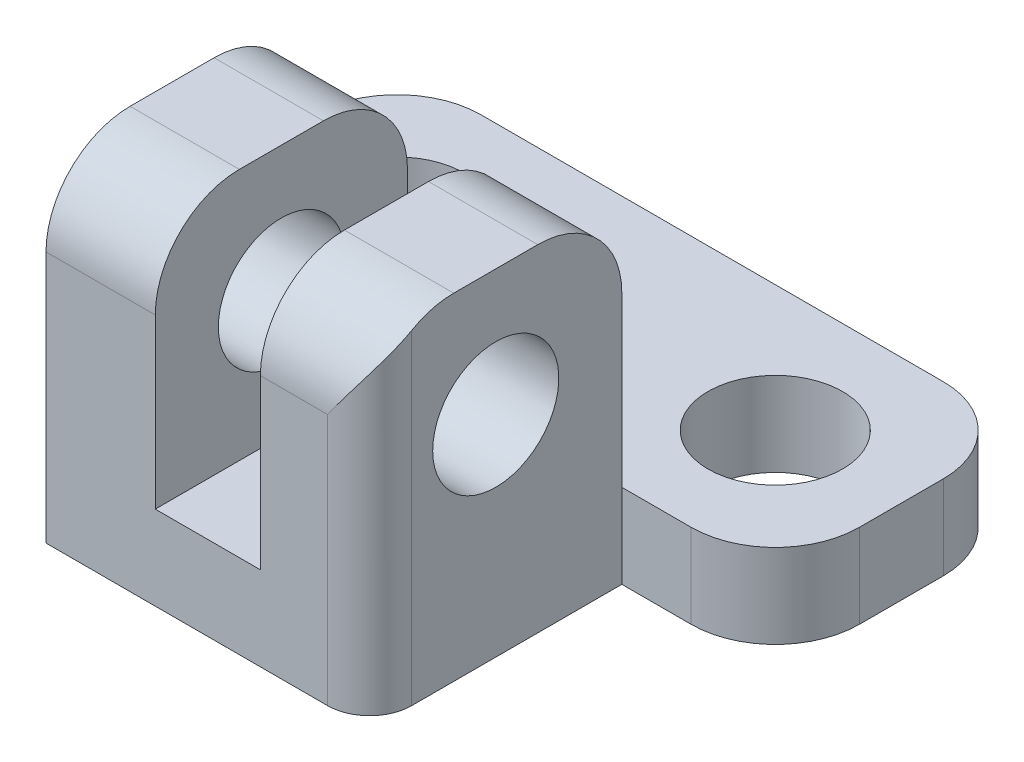
ISO-10303-21;
HEADER;
FILE_DESCRIPTION(('STEP AP214'),'2;1');
FILE_NAME('part.step','',(''),(''),'','','');
FILE_SCHEMA(('AUTOMOTIVE_DESIGN { 1 0 10303 214 1 1 1 1 }'));
ENDSEC;
DATA;
#1=APPLICATION_CONTEXT('core data for automotive mechanical design processes');
#2=APPLICATION_PROTOCOL_DEFINITION('international standard','automotive_design',2000,#1);
#3=PRODUCT_CONTEXT('',#1,'mechanical');
#4=PRODUCT('Part','Part','',(#3));
#5=PRODUCT_RELATED_PRODUCT_CATEGORY('part','',(#4));
#6=PRODUCT_DEFINITION_FORMATION('','',#4);
#7=PRODUCT_DEFINITION_CONTEXT('part definition',#1,'design');
#8=PRODUCT_DEFINITION('design','',#6,#7);
#9=PRODUCT_DEFINITION_SHAPE('','',#8);
#10=(LENGTH_UNIT() NAMED_UNIT(*) SI_UNIT(.MILLI.,.METRE.));
#11=(NAMED_UNIT(*) PLANE_ANGLE_UNIT() SI_UNIT($,.RADIAN.));
#12=(NAMED_UNIT(*) SI_UNIT($,.STERADIAN.) SOLID_ANGLE_UNIT());
#13=UNCERTAINTY_MEASURE_WITH_UNIT(LENGTH_MEASURE(1.E-05),#10,'distance_accuracy_value','');
#14=(GEOMETRIC_REPRESENTATION_CONTEXT(3) GLOBAL_UNCERTAINTY_ASSIGNED_CONTEXT((#13)) GLOBAL_UNIT_ASSIGNED_CONTEXT((#10,
#11,#12)) REPRESENTATION_CONTEXT('',''));
#15=CARTESIAN_POINT('',(0.,0.,0.));
#16=DIRECTION('',(0.,0.,1.));
#17=DIRECTION('',(1.,0.,0.));
#18=AXIS2_PLACEMENT_3D('',#15,#16,#17);
#19=CARTESIAN_POINT('',(0.,8.,-6.));
#20=DIRECTION('',(0.,0.,1.));
#21=DIRECTION('',(1.,0.,0.));
#22=AXIS2_PLACEMENT_3D('',#19,#20,#21);
#23=PLANE('',#22);
#24=DIRECTION('',(0.,-1.,0.));
#25=VECTOR('',#24,1.);
#26=CARTESIAN_POINT('',(0.,8.,-6.));
#27=LINE('',#26,#25);
#28=CARTESIAN_POINT('',(0.,6.,-6.));
#29=VERTEX_POINT('',#28);
#30=CARTESIAN_POINT('',(0.,2.,-6.));
#31=VERTEX_POINT('',#30);
#32=EDGE_CURVE('E219',#29,#31,#27,.T.);
#33=ORIENTED_EDGE('',*,*,#32,.F.);
#34=DIRECTION('',(-1.,0.,0.));
#35=VECTOR('',#34,1.);
#36=CARTESIAN_POINT('',(0.,6.,-6.));
#37=LINE('',#36,#35);
#38=CARTESIAN_POINT('',(2.6,6.,-6.));
#39=VERTEX_POINT('',#38);
#40=EDGE_CURVE('E376',#29,#39,#37,.F.);
#41=ORIENTED_EDGE('',*,*,#40,.T.);
#42=DIRECTION('',(0.,1.,0.));
#43=VECTOR('',#42,1.);
#44=CARTESIAN_POINT('',(2.6,-6.5,-6.));
#45=LINE('',#44,#43);
#46=CARTESIAN_POINT('',(2.6,2.,-6.));
#47=VERTEX_POINT('',#46);
#48=EDGE_CURVE('E303',#47,#39,#45,.T.);
#49=ORIENTED_EDGE('',*,*,#48,.F.);
#50=DIRECTION('',(1.,0.,0.));
#51=VECTOR('',#50,1.);
#52=CARTESIAN_POINT('',(-3.65,2.,-6.));
#53=LINE('',#52,#51);
#54=EDGE_CURVE('E231',#31,#47,#53,.T.);
#55=ORIENTED_EDGE('',*,*,#54,.F.);
#56=EDGE_LOOP('',(#33,#41,#49,#55));
#57=FACE_BOUND('',#56,.T.);
#58=ADVANCED_FACE('F40',(#57),#23,.F.);
#59=DIRECTION('',(0.,1.,0.));
#60=VECTOR('',#59,1.);
#61=CARTESIAN_POINT('',(5.1,-6.5,-6.));
#62=LINE('',#61,#60);
#63=CARTESIAN_POINT('',(5.1,2.,-6.));
#64=VERTEX_POINT('',#63);
#65=CARTESIAN_POINT('',(5.1,6.,-6.));
#66=VERTEX_POINT('',#65);
#67=EDGE_CURVE('E306',#64,#66,#62,.T.);
#68=ORIENTED_EDGE('',*,*,#67,.T.);
#69=DIRECTION('',(-1.,0.,0.));
#70=VECTOR('',#69,1.);
#71=CARTESIAN_POINT('',(0.,6.,-6.));
#72=LINE('',#71,#70);
#73=CARTESIAN_POINT('',(7.7,6.,-6.));
#74=VERTEX_POINT('',#73);
#75=EDGE_CURVE('E202',#66,#74,#72,.F.);
#76=ORIENTED_EDGE('',*,*,#75,.T.);
#77=DIRECTION('',(0.,-1.,0.));
#78=VECTOR('',#77,1.);
#79=CARTESIAN_POINT('',(7.7,8.,-6.));
#80=LINE('',#79,#78);
#81=CARTESIAN_POINT('',(7.7,2.,-6.));
#82=VERTEX_POINT('',#81);
#83=EDGE_CURVE('E194',#74,#82,#80,.T.);
#84=ORIENTED_EDGE('',*,*,#83,.T.);
#85=EDGE_CURVE('E199',#64,#82,#53,.T.);
#86=ORIENTED_EDGE('',*,*,#85,.F.);
#87=EDGE_LOOP('',(#68,#76,#84,#86));
#88=FACE_BOUND('',#87,.T.);
#89=ADVANCED_FACE('F197',(#88),#23,.F.);
#90=CARTESIAN_POINT('',(0.,8.,0.));
#91=DIRECTION('',(0.,-1.,0.));
#92=DIRECTION('',(0.,0.,-1.));
#93=AXIS2_PLACEMENT_3D('',#90,#91,#92);
#94=PLANE('',#93);
#95=DIRECTION('',(0.,0.,-1.));
#96=VECTOR('',#95,1.);
#97=CARTESIAN_POINT('',(7.7,8.,0.));
#98=LINE('',#97,#96);
#99=CARTESIAN_POINT('',(7.7,8.,-2.));
#100=VERTEX_POINT('',#99);
#101=CARTESIAN_POINT('',(7.7,8.,-4.));
#102=VERTEX_POINT('',#101);
#103=EDGE_CURVE('E323',#100,#102,#98,.T.);
#104=ORIENTED_EDGE('',*,*,#103,.T.);
#105=DIRECTION('',(-1.,0.,0.));
#106=VECTOR('',#105,1.);
#107=CARTESIAN_POINT('',(0.,8.,-4.));
#108=LINE('',#107,#106);
#109=CARTESIAN_POINT('',(5.1,8.,-4.));
#110=VERTEX_POINT('',#109);
#111=EDGE_CURVE('E344',#102,#110,#108,.T.);
#112=ORIENTED_EDGE('',*,*,#111,.T.);
#113=DIRECTION('',(0.,0.,-1.));
#114=VECTOR('',#113,1.);
#115=CARTESIAN_POINT('',(5.1,8.,-6.));
#116=LINE('',#115,#114);
#117=CARTESIAN_POINT('',(5.1,8.,-2.));
#118=VERTEX_POINT('',#117);
#119=EDGE_CURVE('E288',#118,#110,#116,.T.);
#120=ORIENTED_EDGE('',*,*,#119,.F.);
#121=DIRECTION('',(1.,0.,0.));
#122=VECTOR('',#121,1.);
#123=CARTESIAN_POINT('',(0.,8.,-2.));
#124=LINE('',#123,#122);
#125=EDGE_CURVE('E241',#118,#100,#124,.T.);
#126=ORIENTED_EDGE('',*,*,#125,.T.);
#127=EDGE_LOOP('',(#104,#112,#120,#126));
#128=FACE_BOUND('',#127,.T.);
#129=ADVANCED_FACE('F510',(#128),#94,.F.);
#130=CARTESIAN_POINT('',(0.,8.,0.));
#131=DIRECTION('',(1.,0.,0.));
#132=DIRECTION('',(0.,0.,-1.));
#133=AXIS2_PLACEMENT_3D('',#130,#131,#132);
#134=PLANE('',#133);
#135=CARTESIAN_POINT('',(0.,5.,-3.));
#136=DIRECTION('',(-1.,0.,0.));
#137=DIRECTION('',(0.,0.,1.));
#138=AXIS2_PLACEMENT_3D('',#135,#136,#137);
#139=CIRCLE('',#138,1.5);
#140=CARTESIAN_POINT('',(0.,5.,-1.5));
#141=VERTEX_POINT('',#140);
#142=EDGE_CURVE('E255',#141,#141,#139,.T.);
#143=ORIENTED_EDGE('',*,*,#142,.F.);
#144=EDGE_LOOP('',(#143));
#145=FACE_BOUND('',#144,.T.);
#146=DIRECTION('',(0.,0.,1.));
#147=VECTOR('',#146,1.);
#148=CARTESIAN_POINT('',(0.,8.,0.));
#149=LINE('',#148,#147);
#150=CARTESIAN_POINT('',(0.,8.,-4.));
#151=VERTEX_POINT('',#150);
#152=CARTESIAN_POINT('',(0.,8.,-2.));
#153=VERTEX_POINT('',#152);
#154=EDGE_CURVE('E319',#151,#153,#149,.T.);
#155=ORIENTED_EDGE('',*,*,#154,.F.);
#156=CARTESIAN_POINT('',(0.,6.,-4.));
#157=DIRECTION('',(1.,0.,0.));
#158=DIRECTION('',(0.,0.,-1.));
#159=AXIS2_PLACEMENT_3D('',#156,#157,#158);
#160=CIRCLE('',#159,2.);
#161=EDGE_CURVE('E373',#151,#29,#160,.F.);
#162=ORIENTED_EDGE('',*,*,#161,.T.);
#163=ORIENTED_EDGE('',*,*,#32,.T.);
#164=CARTESIAN_POINT('',(0.,0.,-6.));
#165=VERTEX_POINT('',#164);
#166=EDGE_CURVE('E327',#31,#165,#27,.T.);
#167=ORIENTED_EDGE('',*,*,#166,.T.);
#168=DIRECTION('',(0.,0.,1.));
#169=VECTOR('',#168,1.);
#170=CARTESIAN_POINT('',(0.,0.,0.));
#171=LINE('',#170,#169);
#172=CARTESIAN_POINT('',(0.,0.,0.));
#173=VERTEX_POINT('',#172);
#174=EDGE_CURVE('E318',#165,#173,#171,.T.);
#175=ORIENTED_EDGE('',*,*,#174,.T.);
#176=DIRECTION('',(0.,-1.,0.));
#177=VECTOR('',#176,1.);
#178=CARTESIAN_POINT('',(0.,8.,0.));
#179=LINE('',#178,#177);
#180=CARTESIAN_POINT('',(0.,6.,0.));
#181=VERTEX_POINT('',#180);
#182=EDGE_CURVE('E206',#181,#173,#179,.T.);
#183=ORIENTED_EDGE('',*,*,#182,.F.);
#184=CARTESIAN_POINT('',(0.,6.,-2.));
#185=DIRECTION('',(1.,0.,0.));
#186=DIRECTION('',(0.,0.,-1.));
#187=AXIS2_PLACEMENT_3D('',#184,#185,#186);
#188=CIRCLE('',#187,2.);
#189=EDGE_CURVE('E370',#181,#153,#188,.F.);
#190=ORIENTED_EDGE('',*,*,#189,.T.);
#191=EDGE_LOOP('',(#155,#162,#163,#167,#175,#183,#190));
#192=FACE_BOUND('',#191,.T.);
#193=ADVANCED_FACE('F522',(#145,#192),#134,.F.);
#194=CARTESIAN_POINT('',(0.,8.,0.));
#195=DIRECTION('',(0.,0.,-1.));
#196=DIRECTION('',(-1.,0.,0.));
#197=AXIS2_PLACEMENT_3D('',#194,#195,#196);
#198=PLANE('',#197);
#199=DIRECTION('',(1.,0.,0.));
#200=VECTOR('',#199,1.);
#201=CARTESIAN_POINT('',(0.,0.,0.));
#202=LINE('',#201,#200);
#203=CARTESIAN_POINT('',(6.7,0.,0.));
#204=VERTEX_POINT('',#203);
#205=EDGE_CURVE('E331',#173,#204,#202,.T.);
#206=ORIENTED_EDGE('',*,*,#205,.T.);
#207=DIRECTION('',(0.,-1.,0.));
#208=VECTOR('',#207,1.);
#209=CARTESIAN_POINT('',(6.7,8.,0.));
#210=LINE('',#209,#208);
#211=CARTESIAN_POINT('',(6.7,6.,0.));
#212=VERTEX_POINT('',#211);
#213=EDGE_CURVE('E55',#204,#212,#210,.F.);
#214=ORIENTED_EDGE('',*,*,#213,.T.);
#215=DIRECTION('',(1.,0.,0.));
#216=VECTOR('',#215,1.);
#217=CARTESIAN_POINT('',(0.,6.,0.));
#218=LINE('',#217,#216);
#219=CARTESIAN_POINT('',(5.1,6.,0.));
#220=VERTEX_POINT('',#219);
#221=EDGE_CURVE('E388',#212,#220,#218,.F.);
#222=ORIENTED_EDGE('',*,*,#221,.T.);
#223=DIRECTION('',(0.,1.,0.));
#224=VECTOR('',#223,1.);
#225=CARTESIAN_POINT('',(5.1,-6.5,0.));
#226=LINE('',#225,#224);
#227=CARTESIAN_POINT('',(5.1,2.,0.));
#228=VERTEX_POINT('',#227);
#229=EDGE_CURVE('E298',#228,#220,#226,.T.);
#230=ORIENTED_EDGE('',*,*,#229,.F.);
#231=DIRECTION('',(1.,0.,0.));
#232=VECTOR('',#231,1.);
#233=CARTESIAN_POINT('',(2.6,2.,0.));
#234=LINE('',#233,#232);
#235=CARTESIAN_POINT('',(2.6,2.,0.));
#236=VERTEX_POINT('',#235);
#237=EDGE_CURVE('E292',#236,#228,#234,.T.);
#238=ORIENTED_EDGE('',*,*,#237,.F.);
#239=DIRECTION('',(0.,1.,0.));
#240=VECTOR('',#239,1.);
#241=CARTESIAN_POINT('',(2.6,-6.5,0.));
#242=LINE('',#241,#240);
#243=CARTESIAN_POINT('',(2.6,6.,0.));
#244=VERTEX_POINT('',#243);
#245=EDGE_CURVE('E302',#236,#244,#242,.T.);
#246=ORIENTED_EDGE('',*,*,#245,.T.);
#247=DIRECTION('',(1.,0.,0.));
#248=VECTOR('',#247,1.);
#249=CARTESIAN_POINT('',(0.,6.,0.));
#250=LINE('',#249,#248);
#251=EDGE_CURVE('E385',#244,#181,#250,.F.);
#252=ORIENTED_EDGE('',*,*,#251,.T.);
#253=ORIENTED_EDGE('',*,*,#182,.T.);
#254=EDGE_LOOP('',(#206,#214,#222,#230,#238,#246,#252,#253));
#255=FACE_BOUND('',#254,.T.);
#256=ADVANCED_FACE('F518',(#255),#198,.F.);
#257=CARTESIAN_POINT('',(7.7,8.,0.));
#258=DIRECTION('',(-1.,0.,0.));
#259=DIRECTION('',(0.,0.,1.));
#260=AXIS2_PLACEMENT_3D('',#257,#258,#259);
#261=PLANE('',#260);
#262=CARTESIAN_POINT('',(7.7,5.,-3.));
#263=DIRECTION('',(-1.,0.,0.));
#264=DIRECTION('',(0.,0.,1.));
#265=AXIS2_PLACEMENT_3D('',#262,#263,#264);
#266=CIRCLE('',#265,1.5);
#267=CARTESIAN_POINT('',(7.7,5.,-1.5));
#268=VERTEX_POINT('',#267);
#269=EDGE_CURVE('E278',#268,#268,#266,.T.);
#270=ORIENTED_EDGE('',*,*,#269,.T.);
#271=EDGE_LOOP('',(#270));
#272=FACE_BOUND('',#271,.T.);
#273=CARTESIAN_POINT('',(7.7,6.,-2.));
#274=DIRECTION('',(-1.,0.,0.));
#275=DIRECTION('',(0.,0.,1.));
#276=AXIS2_PLACEMENT_3D('',#273,#274,#275);
#277=CIRCLE('',#276,2.);
#278=CARTESIAN_POINT('',(7.7,7.73205080756888,-1.));
#279=VERTEX_POINT('',#278);
#280=EDGE_CURVE('E356',#100,#279,#277,.F.);
#281=ORIENTED_EDGE('',*,*,#280,.T.);
#282=DIRECTION('',(0.,-1.,0.));
#283=VECTOR('',#282,1.);
#284=CARTESIAN_POINT('',(7.7,8.,-1.));
#285=LINE('',#284,#283);
#286=CARTESIAN_POINT('',(7.7,0.,-1.));
#287=VERTEX_POINT('',#286);
#288=EDGE_CURVE('E442',#279,#287,#285,.T.);
#289=ORIENTED_EDGE('',*,*,#288,.T.);
#290=DIRECTION('',(0.,0.,-1.));
#291=VECTOR('',#290,1.);
#292=CARTESIAN_POINT('',(7.7,0.,0.));
#293=LINE('',#292,#291);
#294=CARTESIAN_POINT('',(7.7,0.,-6.));
#295=VERTEX_POINT('',#294);
#296=EDGE_CURVE('E214',#287,#295,#293,.T.);
#297=ORIENTED_EDGE('',*,*,#296,.T.);
#298=EDGE_CURVE('E207',#82,#295,#80,.T.);
#299=ORIENTED_EDGE('',*,*,#298,.F.);
#300=ORIENTED_EDGE('',*,*,#83,.F.);
#301=CARTESIAN_POINT('',(7.7,6.,-4.));
#302=DIRECTION('',(-1.,0.,0.));
#303=DIRECTION('',(0.,0.,1.));
#304=AXIS2_PLACEMENT_3D('',#301,#302,#303);
#305=CIRCLE('',#304,2.);
#306=EDGE_CURVE('E359',#74,#102,#305,.F.);
#307=ORIENTED_EDGE('',*,*,#306,.T.);
#308=ORIENTED_EDGE('',*,*,#103,.F.);
#309=EDGE_LOOP('',(#281,#289,#297,#299,#300,#307,#308));
#310=FACE_BOUND('',#309,.T.);
#311=ADVANCED_FACE('F212',(#272,#310),#261,.F.);
#312=DIRECTION('',(0.,0.,1.));
#313=VECTOR('',#312,1.);
#314=CARTESIAN_POINT('',(2.6,8.,-6.));
#315=LINE('',#314,#313);
#316=CARTESIAN_POINT('',(2.6,8.,-4.));
#317=VERTEX_POINT('',#316);
#318=CARTESIAN_POINT('',(2.6,8.,-2.));
#319=VERTEX_POINT('',#318);
#320=EDGE_CURVE('E287',#317,#319,#315,.T.);
#321=ORIENTED_EDGE('',*,*,#320,.F.);
#322=DIRECTION('',(-1.,0.,0.));
#323=VECTOR('',#322,1.);
#324=CARTESIAN_POINT('',(0.,8.,-4.));
#325=LINE('',#324,#323);
#326=EDGE_CURVE('E366',#317,#151,#325,.T.);
#327=ORIENTED_EDGE('',*,*,#326,.T.);
#328=ORIENTED_EDGE('',*,*,#154,.T.);
#329=DIRECTION('',(1.,0.,0.));
#330=VECTOR('',#329,1.);
#331=CARTESIAN_POINT('',(0.,8.,-2.));
#332=LINE('',#331,#330);
#333=EDGE_CURVE('E362',#153,#319,#332,.T.);
#334=ORIENTED_EDGE('',*,*,#333,.T.);
#335=EDGE_LOOP('',(#321,#327,#328,#334));
#336=FACE_BOUND('',#335,.T.);
#337=ADVANCED_FACE('F517',(#336),#94,.F.);
#338=CARTESIAN_POINT('',(0.,0.,0.));
#339=DIRECTION('',(0.,-1.,0.));
#340=DIRECTION('',(0.,0.,-1.));
#341=AXIS2_PLACEMENT_3D('',#338,#339,#340);
#342=PLANE('',#341);
#343=CARTESIAN_POINT('',(-0.65,0.,-9.));
#344=DIRECTION('',(0.,1.,0.));
#345=DIRECTION('',(0.,0.,1.));
#346=AXIS2_PLACEMENT_3D('',#343,#344,#345);
#347=CIRCLE('',#346,1.6);
#348=CARTESIAN_POINT('',(-0.65,0.,-7.4));
#349=VERTEX_POINT('',#348);
#350=EDGE_CURVE('E471',#349,#349,#347,.T.);
#351=ORIENTED_EDGE('',*,*,#350,.T.);
#352=EDGE_LOOP('',(#351));
#353=FACE_BOUND('',#352,.T.);
#354=CARTESIAN_POINT('',(8.35,0.,-9.));
#355=DIRECTION('',(0.,1.,0.));
#356=DIRECTION('',(0.,0.,1.));
#357=AXIS2_PLACEMENT_3D('',#354,#355,#356);
#358=CIRCLE('',#357,1.6);
#359=CARTESIAN_POINT('',(8.35,0.,-7.4));
#360=VERTEX_POINT('',#359);
#361=EDGE_CURVE('E263',#360,#360,#358,.T.);
#362=ORIENTED_EDGE('',*,*,#361,.T.);
#363=EDGE_LOOP('',(#362));
#364=FACE_BOUND('',#363,.T.);
#365=ORIENTED_EDGE('',*,*,#296,.F.);
#366=CARTESIAN_POINT('',(6.7,0.,-1.));
#367=DIRECTION('',(0.,-1.,0.));
#368=DIRECTION('',(0.,0.,-1.));
#369=AXIS2_PLACEMENT_3D('',#366,#367,#368);
#370=CIRCLE('',#369,1.);
#371=EDGE_CURVE('E69',#287,#204,#370,.T.);
#372=ORIENTED_EDGE('',*,*,#371,.T.);
#373=ORIENTED_EDGE('',*,*,#205,.F.);
#374=ORIENTED_EDGE('',*,*,#174,.F.);
#375=DIRECTION('',(-1.,0.,0.));
#376=VECTOR('',#375,1.);
#377=CARTESIAN_POINT('',(-3.65,0.,-6.));
#378=LINE('',#377,#376);
#379=CARTESIAN_POINT('',(-1.65,0.,-6.));
#380=VERTEX_POINT('',#379);
#381=EDGE_CURVE('E271',#165,#380,#378,.T.);
#382=ORIENTED_EDGE('',*,*,#381,.T.);
#383=CARTESIAN_POINT('',(-1.65,0.,-8.));
#384=DIRECTION('',(0.,-1.,0.));
#385=DIRECTION('',(0.,0.,-1.));
#386=AXIS2_PLACEMENT_3D('',#383,#384,#385);
#387=CIRCLE('',#386,2.);
#388=CARTESIAN_POINT('',(-3.65,0.,-8.));
#389=VERTEX_POINT('',#388);
#390=EDGE_CURVE('E404',#380,#389,#387,.T.);
#391=ORIENTED_EDGE('',*,*,#390,.T.);
#392=DIRECTION('',(0.,0.,-1.));
#393=VECTOR('',#392,1.);
#394=CARTESIAN_POINT('',(-3.65,0.,-6.));
#395=LINE('',#394,#393);
#396=CARTESIAN_POINT('',(-3.65,0.,-10.));
#397=VERTEX_POINT('',#396);
#398=EDGE_CURVE('E258',#389,#397,#395,.T.);
#399=ORIENTED_EDGE('',*,*,#398,.T.);
#400=CARTESIAN_POINT('',(-1.65,0.,-10.));
#401=DIRECTION('',(0.,-1.,0.));
#402=DIRECTION('',(0.,0.,-1.));
#403=AXIS2_PLACEMENT_3D('',#400,#401,#402);
#404=CIRCLE('',#403,2.);
#405=CARTESIAN_POINT('',(-1.65,0.,-12.));
#406=VERTEX_POINT('',#405);
#407=EDGE_CURVE('E395',#397,#406,#404,.T.);
#408=ORIENTED_EDGE('',*,*,#407,.T.);
#409=DIRECTION('',(1.,0.,0.));
#410=VECTOR('',#409,1.);
#411=CARTESIAN_POINT('',(-3.65,0.,-12.));
#412=LINE('',#411,#410);
#413=CARTESIAN_POINT('',(9.35,0.,-12.));
#414=VERTEX_POINT('',#413);
#415=EDGE_CURVE('E262',#406,#414,#412,.T.);
#416=ORIENTED_EDGE('',*,*,#415,.T.);
#417=CARTESIAN_POINT('',(9.35,0.,-10.));
#418=DIRECTION('',(0.,-1.,0.));
#419=DIRECTION('',(0.,0.,-1.));
#420=AXIS2_PLACEMENT_3D('',#417,#418,#419);
#421=CIRCLE('',#420,2.);
#422=CARTESIAN_POINT('',(11.35,0.,-10.));
#423=VERTEX_POINT('',#422);
#424=EDGE_CURVE('E398',#414,#423,#421,.T.);
#425=ORIENTED_EDGE('',*,*,#424,.T.);
#426=DIRECTION('',(0.,0.,1.));
#427=VECTOR('',#426,1.);
#428=CARTESIAN_POINT('',(11.35,0.,-6.));
#429=LINE('',#428,#427);
#430=CARTESIAN_POINT('',(11.35,0.,-8.));
#431=VERTEX_POINT('',#430);
#432=EDGE_CURVE('E267',#423,#431,#429,.T.);
#433=ORIENTED_EDGE('',*,*,#432,.T.);
#434=CARTESIAN_POINT('',(9.35,0.,-8.));
#435=DIRECTION('',(0.,-1.,0.));
#436=DIRECTION('',(0.,0.,-1.));
#437=AXIS2_PLACEMENT_3D('',#434,#435,#436);
#438=CIRCLE('',#437,2.);
#439=CARTESIAN_POINT('',(9.35,0.,-6.));
#440=VERTEX_POINT('',#439);
#441=EDGE_CURVE('E401',#431,#440,#438,.T.);
#442=ORIENTED_EDGE('',*,*,#441,.T.);
#443=EDGE_CURVE('E272',#440,#295,#378,.T.);
#444=ORIENTED_EDGE('',*,*,#443,.T.);
#445=EDGE_LOOP('',(#365,#372,#373,#374,#382,#391,#399,#408,#416,#425,#433,#442,#444));
#446=FACE_BOUND('',#445,.T.);
#447=ADVANCED_FACE('F451',(#353,#364,#446),#342,.T.);
#448=CARTESIAN_POINT('',(0.,2.,0.));
#449=DIRECTION('',(0.,-1.,0.));
#450=DIRECTION('',(0.,0.,-1.));
#451=AXIS2_PLACEMENT_3D('',#448,#449,#450);
#452=PLANE('',#451);
#453=CARTESIAN_POINT('',(-0.65,2.,-9.));
#454=DIRECTION('',(0.,1.,0.));
#455=DIRECTION('',(0.,0.,1.));
#456=AXIS2_PLACEMENT_3D('',#453,#454,#455);
#457=CIRCLE('',#456,1.6);
#458=CARTESIAN_POINT('',(-0.65,2.,-7.4));
#459=VERTEX_POINT('',#458);
#460=EDGE_CURVE('E475',#459,#459,#457,.T.);
#461=ORIENTED_EDGE('',*,*,#460,.F.);
#462=EDGE_LOOP('',(#461));
#463=FACE_BOUND('',#462,.T.);
#464=CARTESIAN_POINT('',(8.35,2.,-9.));
#465=DIRECTION('',(0.,1.,0.));
#466=DIRECTION('',(0.,0.,1.));
#467=AXIS2_PLACEMENT_3D('',#464,#465,#466);
#468=CIRCLE('',#467,1.6);
#469=CARTESIAN_POINT('',(8.35,2.,-7.4));
#470=VERTEX_POINT('',#469);
#471=EDGE_CURVE('E467',#470,#470,#468,.T.);
#472=ORIENTED_EDGE('',*,*,#471,.F.);
#473=EDGE_LOOP('',(#472));
#474=FACE_BOUND('',#473,.T.);
#475=DIRECTION('',(0.,0.,1.));
#476=VECTOR('',#475,1.);
#477=CARTESIAN_POINT('',(-3.65,2.,-6.));
#478=LINE('',#477,#476);
#479=CARTESIAN_POINT('',(-3.65,2.,-10.));
#480=VERTEX_POINT('',#479);
#481=CARTESIAN_POINT('',(-3.65,2.,-8.));
#482=VERTEX_POINT('',#481);
#483=EDGE_CURVE('E246',#480,#482,#478,.T.);
#484=ORIENTED_EDGE('',*,*,#483,.T.);
#485=CARTESIAN_POINT('',(-1.65,2.,-8.));
#486=DIRECTION('',(0.,-1.,0.));
#487=DIRECTION('',(0.,0.,-1.));
#488=AXIS2_PLACEMENT_3D('',#485,#486,#487);
#489=CIRCLE('',#488,2.);
#490=CARTESIAN_POINT('',(-1.65,2.,-6.));
#491=VERTEX_POINT('',#490);
#492=EDGE_CURVE('E423',#482,#491,#489,.F.);
#493=ORIENTED_EDGE('',*,*,#492,.T.);
#494=EDGE_CURVE('E228',#491,#31,#53,.T.);
#495=ORIENTED_EDGE('',*,*,#494,.T.);
#496=ORIENTED_EDGE('',*,*,#54,.T.);
#497=DIRECTION('',(0.,0.,1.));
#498=VECTOR('',#497,1.);
#499=CARTESIAN_POINT('',(2.6,2.,-6.));
#500=LINE('',#499,#498);
#501=EDGE_CURVE('E299',#47,#236,#500,.T.);
#502=ORIENTED_EDGE('',*,*,#501,.T.);
#503=ORIENTED_EDGE('',*,*,#237,.T.);
#504=DIRECTION('',(0.,0.,-1.));
#505=VECTOR('',#504,1.);
#506=CARTESIAN_POINT('',(5.1,2.,-6.));
#507=LINE('',#506,#505);
#508=EDGE_CURVE('E236',#228,#64,#507,.T.);
#509=ORIENTED_EDGE('',*,*,#508,.T.);
#510=ORIENTED_EDGE('',*,*,#85,.T.);
#511=CARTESIAN_POINT('',(9.35,2.,-6.));
#512=VERTEX_POINT('',#511);
#513=EDGE_CURVE('E221',#82,#512,#53,.T.);
#514=ORIENTED_EDGE('',*,*,#513,.T.);
#515=CARTESIAN_POINT('',(9.35,2.,-8.));
#516=DIRECTION('',(0.,-1.,0.));
#517=DIRECTION('',(0.,0.,-1.));
#518=AXIS2_PLACEMENT_3D('',#515,#516,#517);
#519=CIRCLE('',#518,2.);
#520=CARTESIAN_POINT('',(11.35,2.,-8.));
#521=VERTEX_POINT('',#520);
#522=EDGE_CURVE('E420',#512,#521,#519,.F.);
#523=ORIENTED_EDGE('',*,*,#522,.T.);
#524=DIRECTION('',(0.,0.,-1.));
#525=VECTOR('',#524,1.);
#526=CARTESIAN_POINT('',(11.35,2.,-6.));
#527=LINE('',#526,#525);
#528=CARTESIAN_POINT('',(11.35,2.,-10.));
#529=VERTEX_POINT('',#528);
#530=EDGE_CURVE('E229',#521,#529,#527,.T.);
#531=ORIENTED_EDGE('',*,*,#530,.T.);
#532=CARTESIAN_POINT('',(9.35,2.,-10.));
#533=DIRECTION('',(0.,-1.,0.));
#534=DIRECTION('',(0.,0.,-1.));
#535=AXIS2_PLACEMENT_3D('',#532,#533,#534);
#536=CIRCLE('',#535,2.);
#537=CARTESIAN_POINT('',(9.35,2.,-12.));
#538=VERTEX_POINT('',#537);
#539=EDGE_CURVE('E417',#529,#538,#536,.F.);
#540=ORIENTED_EDGE('',*,*,#539,.T.);
#541=DIRECTION('',(-1.,0.,0.));
#542=VECTOR('',#541,1.);
#543=CARTESIAN_POINT('',(-3.65,2.,-12.));
#544=LINE('',#543,#542);
#545=CARTESIAN_POINT('',(-1.65,2.,-12.));
#546=VERTEX_POINT('',#545);
#547=EDGE_CURVE('E250',#538,#546,#544,.T.);
#548=ORIENTED_EDGE('',*,*,#547,.T.);
#549=CARTESIAN_POINT('',(-1.65,2.,-10.));
#550=DIRECTION('',(0.,-1.,0.));
#551=DIRECTION('',(0.,0.,-1.));
#552=AXIS2_PLACEMENT_3D('',#549,#550,#551);
#553=CIRCLE('',#552,2.);
#554=EDGE_CURVE('E414',#546,#480,#553,.F.);
#555=ORIENTED_EDGE('',*,*,#554,.T.);
#556=EDGE_LOOP('',(#484,#493,#495,#496,#502,#503,#509,#510,#514,#523,#531,#540,#548,#555));
#557=FACE_BOUND('',#556,.T.);
#558=ADVANCED_FACE('F234',(#463,#474,#557),#452,.F.);
#559=CARTESIAN_POINT('',(5.1,-6.5,-6.));
#560=DIRECTION('',(1.,0.,0.));
#561=DIRECTION('',(0.,0.,-1.));
#562=AXIS2_PLACEMENT_3D('',#559,#560,#561);
#563=PLANE('',#562);
#564=CARTESIAN_POINT('',(5.1,5.,-3.));
#565=DIRECTION('',(1.,0.,0.));
#566=DIRECTION('',(0.,0.,-1.));
#567=AXIS2_PLACEMENT_3D('',#564,#565,#566);
#568=CIRCLE('',#567,1.5);
#569=CARTESIAN_POINT('',(5.1,5.,-4.5));
#570=VERTEX_POINT('',#569);
#571=EDGE_CURVE('E282',#570,#570,#568,.T.);
#572=ORIENTED_EDGE('',*,*,#571,.T.);
#573=EDGE_LOOP('',(#572));
#574=FACE_BOUND('',#573,.T.);
#575=ORIENTED_EDGE('',*,*,#119,.T.);
#576=CARTESIAN_POINT('',(5.1,6.,-4.));
#577=DIRECTION('',(1.,0.,0.));
#578=DIRECTION('',(0.,0.,-1.));
#579=AXIS2_PLACEMENT_3D('',#576,#577,#578);
#580=CIRCLE('',#579,2.);
#581=EDGE_CURVE('E351',#110,#66,#580,.F.);
#582=ORIENTED_EDGE('',*,*,#581,.T.);
#583=ORIENTED_EDGE('',*,*,#67,.F.);
#584=ORIENTED_EDGE('',*,*,#508,.F.);
#585=ORIENTED_EDGE('',*,*,#229,.T.);
#586=CARTESIAN_POINT('',(5.1,6.,-2.));
#587=DIRECTION('',(1.,0.,0.));
#588=DIRECTION('',(0.,0.,-1.));
#589=AXIS2_PLACEMENT_3D('',#586,#587,#588);
#590=CIRCLE('',#589,2.);
#591=EDGE_CURVE('E348',#220,#118,#590,.F.);
#592=ORIENTED_EDGE('',*,*,#591,.T.);
#593=EDGE_LOOP('',(#575,#582,#583,#584,#585,#592));
#594=FACE_BOUND('',#593,.T.);
#595=ADVANCED_FACE('F484',(#574,#594),#563,.F.);
#596=CARTESIAN_POINT('',(2.6,-6.5,-6.));
#597=DIRECTION('',(-1.,0.,0.));
#598=DIRECTION('',(0.,0.,1.));
#599=AXIS2_PLACEMENT_3D('',#596,#597,#598);
#600=PLANE('',#599);
#601=CARTESIAN_POINT('',(2.6,5.,-3.));
#602=DIRECTION('',(-1.,0.,0.));
#603=DIRECTION('',(0.,0.,1.));
#604=AXIS2_PLACEMENT_3D('',#601,#602,#603);
#605=CIRCLE('',#604,1.5);
#606=CARTESIAN_POINT('',(2.6,5.,-1.5));
#607=VERTEX_POINT('',#606);
#608=EDGE_CURVE('E283',#607,#607,#605,.T.);
#609=ORIENTED_EDGE('',*,*,#608,.T.);
#610=EDGE_LOOP('',(#609));
#611=FACE_BOUND('',#610,.T.);
#612=ORIENTED_EDGE('',*,*,#48,.T.);
#613=CARTESIAN_POINT('',(2.6,6.,-4.));
#614=DIRECTION('',(-1.,0.,0.));
#615=DIRECTION('',(0.,0.,1.));
#616=AXIS2_PLACEMENT_3D('',#613,#614,#615);
#617=CIRCLE('',#616,2.);
#618=EDGE_CURVE('E382',#39,#317,#617,.F.);
#619=ORIENTED_EDGE('',*,*,#618,.T.);
#620=ORIENTED_EDGE('',*,*,#320,.T.);
#621=CARTESIAN_POINT('',(2.6,6.,-2.));
#622=DIRECTION('',(-1.,0.,0.));
#623=DIRECTION('',(0.,0.,1.));
#624=AXIS2_PLACEMENT_3D('',#621,#622,#623);
#625=CIRCLE('',#624,2.);
#626=EDGE_CURVE('E379',#319,#244,#625,.F.);
#627=ORIENTED_EDGE('',*,*,#626,.T.);
#628=ORIENTED_EDGE('',*,*,#245,.F.);
#629=ORIENTED_EDGE('',*,*,#501,.F.);
#630=EDGE_LOOP('',(#612,#619,#620,#627,#628,#629));
#631=FACE_BOUND('',#630,.T.);
#632=ADVANCED_FACE('F593',(#611,#631),#600,.F.);
#633=CARTESIAN_POINT('',(0.,5.,-3.));
#634=DIRECTION('',(-1.,0.,0.));
#635=DIRECTION('',(0.,0.,1.));
#636=AXIS2_PLACEMENT_3D('',#633,#634,#635);
#637=CYLINDRICAL_SURFACE('',#636,1.5);
#638=ORIENTED_EDGE('',*,*,#269,.F.);
#639=EDGE_LOOP('',(#638));
#640=FACE_BOUND('',#639,.T.);
#641=ORIENTED_EDGE('',*,*,#571,.F.);
#642=EDGE_LOOP('',(#641));
#643=FACE_BOUND('',#642,.T.);
#644=ADVANCED_FACE('F595',(#640,#643),#637,.F.);
#645=ORIENTED_EDGE('',*,*,#142,.T.);
#646=EDGE_LOOP('',(#645));
#647=FACE_BOUND('',#646,.T.);
#648=ORIENTED_EDGE('',*,*,#608,.F.);
#649=EDGE_LOOP('',(#648));
#650=FACE_BOUND('',#649,.T.);
#651=ADVANCED_FACE('F602',(#647,#650),#637,.F.);
#652=CARTESIAN_POINT('',(-3.65,18.1554944214035,-6.));
#653=DIRECTION('',(0.,0.,1.));
#654=DIRECTION('',(1.,0.,0.));
#655=AXIS2_PLACEMENT_3D('',#652,#653,#654);
#656=PLANE('',#655);
#657=ORIENTED_EDGE('',*,*,#494,.F.);
#658=DIRECTION('',(0.,-1.,0.));
#659=VECTOR('',#658,1.);
#660=CARTESIAN_POINT('',(-1.65,18.1554944214035,-6.));
#661=LINE('',#660,#659);
#662=EDGE_CURVE('E391',#491,#380,#661,.T.);
#663=ORIENTED_EDGE('',*,*,#662,.T.);
#664=ORIENTED_EDGE('',*,*,#381,.F.);
#665=ORIENTED_EDGE('',*,*,#166,.F.);
#666=EDGE_LOOP('',(#657,#663,#664,#665));
#667=FACE_BOUND('',#666,.T.);
#668=ADVANCED_FACE('F567',(#667),#656,.T.);
#669=CARTESIAN_POINT('',(-3.65,18.1554944214035,-6.));
#670=DIRECTION('',(-1.,0.,0.));
#671=DIRECTION('',(0.,0.,1.));
#672=AXIS2_PLACEMENT_3D('',#669,#670,#671);
#673=PLANE('',#672);
#674=ORIENTED_EDGE('',*,*,#398,.F.);
#675=DIRECTION('',(0.,-1.,0.));
#676=VECTOR('',#675,1.);
#677=CARTESIAN_POINT('',(-3.65,18.1554944214035,-8.));
#678=LINE('',#677,#676);
#679=EDGE_CURVE('E411',#389,#482,#678,.F.);
#680=ORIENTED_EDGE('',*,*,#679,.T.);
#681=ORIENTED_EDGE('',*,*,#483,.F.);
#682=DIRECTION('',(0.,-1.,0.));
#683=VECTOR('',#682,1.);
#684=CARTESIAN_POINT('',(-3.65,18.1554944214035,-10.));
#685=LINE('',#684,#683);
#686=EDGE_CURVE('E407',#480,#397,#685,.T.);
#687=ORIENTED_EDGE('',*,*,#686,.T.);
#688=EDGE_LOOP('',(#674,#680,#681,#687));
#689=FACE_BOUND('',#688,.T.);
#690=ADVANCED_FACE('F562',(#689),#673,.T.);
#691=ORIENTED_EDGE('',*,*,#443,.F.);
#692=DIRECTION('',(0.,-1.,0.));
#693=VECTOR('',#692,1.);
#694=CARTESIAN_POINT('',(9.35,18.1554944214035,-6.));
#695=LINE('',#694,#693);
#696=EDGE_CURVE('E224',#440,#512,#695,.F.);
#697=ORIENTED_EDGE('',*,*,#696,.T.);
#698=ORIENTED_EDGE('',*,*,#513,.F.);
#699=ORIENTED_EDGE('',*,*,#298,.T.);
#700=EDGE_LOOP('',(#691,#697,#698,#699));
#701=FACE_BOUND('',#700,.T.);
#702=ADVANCED_FACE('F222',(#701),#656,.T.);
#703=CARTESIAN_POINT('',(11.35,18.1554944214035,-6.));
#704=DIRECTION('',(1.,0.,0.));
#705=DIRECTION('',(0.,0.,-1.));
#706=AXIS2_PLACEMENT_3D('',#703,#704,#705);
#707=PLANE('',#706);
#708=ORIENTED_EDGE('',*,*,#530,.F.);
#709=DIRECTION('',(0.,-1.,0.));
#710=VECTOR('',#709,1.);
#711=CARTESIAN_POINT('',(11.35,18.1554944214035,-8.));
#712=LINE('',#711,#710);
#713=EDGE_CURVE('E429',#521,#431,#712,.T.);
#714=ORIENTED_EDGE('',*,*,#713,.T.);
#715=ORIENTED_EDGE('',*,*,#432,.F.);
#716=DIRECTION('',(0.,-1.,0.));
#717=VECTOR('',#716,1.);
#718=CARTESIAN_POINT('',(11.35,18.1554944214035,-10.));
#719=LINE('',#718,#717);
#720=EDGE_CURVE('E426',#423,#529,#719,.F.);
#721=ORIENTED_EDGE('',*,*,#720,.T.);
#722=EDGE_LOOP('',(#708,#714,#715,#721));
#723=FACE_BOUND('',#722,.T.);
#724=ADVANCED_FACE('F459',(#723),#707,.T.);
#725=CARTESIAN_POINT('',(-3.65,18.1554944214035,-12.));
#726=DIRECTION('',(0.,0.,-1.));
#727=DIRECTION('',(-1.,0.,0.));
#728=AXIS2_PLACEMENT_3D('',#725,#726,#727);
#729=PLANE('',#728);
#730=ORIENTED_EDGE('',*,*,#547,.F.);
#731=DIRECTION('',(0.,-1.,0.));
#732=VECTOR('',#731,1.);
#733=CARTESIAN_POINT('',(9.35,18.1554944214035,-12.));
#734=LINE('',#733,#732);
#735=EDGE_CURVE('E438',#538,#414,#734,.T.);
#736=ORIENTED_EDGE('',*,*,#735,.T.);
#737=ORIENTED_EDGE('',*,*,#415,.F.);
#738=DIRECTION('',(0.,-1.,0.));
#739=VECTOR('',#738,1.);
#740=CARTESIAN_POINT('',(-1.65,18.1554944214035,-12.));
#741=LINE('',#740,#739);
#742=EDGE_CURVE('E435',#406,#546,#741,.F.);
#743=ORIENTED_EDGE('',*,*,#742,.T.);
#744=EDGE_LOOP('',(#730,#736,#737,#743));
#745=FACE_BOUND('',#744,.T.);
#746=ADVANCED_FACE('F490',(#745),#729,.T.);
#747=CARTESIAN_POINT('',(8.35,2.,-9.));
#748=DIRECTION('',(0.,1.,0.));
#749=DIRECTION('',(0.,0.,1.));
#750=AXIS2_PLACEMENT_3D('',#747,#748,#749);
#751=CYLINDRICAL_SURFACE('',#750,1.6);
#752=ORIENTED_EDGE('',*,*,#361,.F.);
#753=EDGE_LOOP('',(#752));
#754=FACE_BOUND('',#753,.T.);
#755=ORIENTED_EDGE('',*,*,#471,.T.);
#756=EDGE_LOOP('',(#755));
#757=FACE_BOUND('',#756,.T.);
#758=ADVANCED_FACE('F488',(#754,#757),#751,.F.);
#759=CARTESIAN_POINT('',(-0.65,2.,-9.));
#760=DIRECTION('',(0.,1.,0.));
#761=DIRECTION('',(0.,0.,1.));
#762=AXIS2_PLACEMENT_3D('',#759,#760,#761);
#763=CYLINDRICAL_SURFACE('',#762,1.6);
#764=ORIENTED_EDGE('',*,*,#350,.F.);
#765=EDGE_LOOP('',(#764));
#766=FACE_BOUND('',#765,.T.);
#767=ORIENTED_EDGE('',*,*,#460,.T.);
#768=EDGE_LOOP('',(#767));
#769=FACE_BOUND('',#768,.T.);
#770=ADVANCED_FACE('F480',(#766,#769),#763,.F.);
#771=CARTESIAN_POINT('',(0.,6.,-4.));
#772=DIRECTION('',(-1.,0.,0.));
#773=DIRECTION('',(0.,0.,1.));
#774=AXIS2_PLACEMENT_3D('',#771,#772,#773);
#775=CYLINDRICAL_SURFACE('',#774,2.);
#776=ORIENTED_EDGE('',*,*,#306,.F.);
#777=ORIENTED_EDGE('',*,*,#75,.F.);
#778=ORIENTED_EDGE('',*,*,#581,.F.);
#779=ORIENTED_EDGE('',*,*,#111,.F.);
#780=EDGE_LOOP('',(#776,#777,#778,#779));
#781=FACE_BOUND('',#780,.T.);
#782=ADVANCED_FACE('F497',(#781),#775,.T.);
#783=CARTESIAN_POINT('',(0.,6.,-4.));
#784=DIRECTION('',(-1.,0.,0.));
#785=DIRECTION('',(0.,0.,1.));
#786=AXIS2_PLACEMENT_3D('',#783,#784,#785);
#787=CYLINDRICAL_SURFACE('',#786,2.);
#788=ORIENTED_EDGE('',*,*,#618,.F.);
#789=ORIENTED_EDGE('',*,*,#40,.F.);
#790=ORIENTED_EDGE('',*,*,#161,.F.);
#791=ORIENTED_EDGE('',*,*,#326,.F.);
#792=EDGE_LOOP('',(#788,#789,#790,#791));
#793=FACE_BOUND('',#792,.T.);
#794=ADVANCED_FACE('F528',(#793),#787,.T.);
#795=CARTESIAN_POINT('',(0.,6.,-2.));
#796=DIRECTION('',(1.,0.,0.));
#797=DIRECTION('',(0.,0.,-1.));
#798=AXIS2_PLACEMENT_3D('',#795,#796,#797);
#799=CYLINDRICAL_SURFACE('',#798,2.);
#800=ORIENTED_EDGE('',*,*,#221,.F.);
#801=CARTESIAN_POINT('',(7.7,7.73205080756888,-1.));
#802=CARTESIAN_POINT('',(7.70000019431164,7.71043880922316,-0.962540440473652));
#803=CARTESIAN_POINT('',(7.69789680203802,7.68761503801685,-0.925839178647106));
#804=CARTESIAN_POINT('',(7.68998659235741,7.63990827899371,-0.854343563200493));
#805=CARTESIAN_POINT('',(7.68418915961089,7.61503064798418,-0.819544619314149));
#806=CARTESIAN_POINT('',(7.66948764080383,7.56380959864439,-0.752498445155922));
#807=CARTESIAN_POINT('',(7.66062573015754,7.53748996595523,-0.720223516844292));
#808=CARTESIAN_POINT('',(7.6402147841779,7.48334561415861,-0.657839717931808));
#809=CARTESIAN_POINT('',(7.62866376857337,7.45551979753571,-0.627732465115385));
#810=CARTESIAN_POINT('',(7.58576723248944,7.35935315079066,-0.529801881921772));
#811=CARTESIAN_POINT('',(7.54907849657492,7.28801934886696,-0.467174374317349));
#812=CARTESIAN_POINT('',(7.46681233160588,7.14036373947806,-0.354310829042962));
#813=CARTESIAN_POINT('',(7.42118241178426,7.06401433769976,-0.304152140962916));
#814=CARTESIAN_POINT('',(7.30433459554436,6.87660072708239,-0.197944758901713));
#815=CARTESIAN_POINT('',(7.23024184432824,6.76400936022429,-0.147749574930199));
#816=CARTESIAN_POINT('',(7.07602060504673,6.53589871117259,-0.0693627748482128));
#817=CARTESIAN_POINT('',(6.99590006593815,6.42038341380209,-0.0411427187149067));
#818=CARTESIAN_POINT('',(6.8453164388501,6.20552825981412,-0.00809073030030558));
#819=CARTESIAN_POINT('',(6.77521774765074,6.10637442794025,-0.000374895763335555));
#820=CARTESIAN_POINT('',(6.70344261611507,6.0048685950784,-4.44910876729324E-06));
#821=CARTESIAN_POINT('',(6.70172128716934,6.00243426848871,-5.18405323540669E-09));
#822=CARTESIAN_POINT('',(6.7,6.,0.));
#823=B_SPLINE_CURVE_WITH_KNOTS('',3,(#801,#802,#803,#804,#805,#806,#807,#808,#809,#810,#811,
#812,#813,#814,#815,#816,#817,#818,#819,#820,#821,#822),.UNSPECIFIED.,.F.,.F.,(4,2,2,2,2,2,2,2,
2,2,4),(0.,0.12959229529458,0.25885666865277,0.386408509268408,0.514054578529991,
0.817592410147225,1.1229686971365,1.55212503753218,1.98072504008937,2.34472916750579,
2.35367344935465),.UNSPECIFIED.);
#824=EDGE_CURVE('E12',#212,#279,#823,.F.);
#825=ORIENTED_EDGE('',*,*,#824,.T.);
#826=ORIENTED_EDGE('',*,*,#280,.F.);
#827=ORIENTED_EDGE('',*,*,#125,.F.);
#828=ORIENTED_EDGE('',*,*,#591,.F.);
#829=EDGE_LOOP('',(#800,#825,#826,#827,#828));
#830=FACE_BOUND('',#829,.T.);
#831=ADVANCED_FACE('F531',(#830),#799,.T.);
#832=CARTESIAN_POINT('',(0.,6.,-2.));
#833=DIRECTION('',(1.,0.,0.));
#834=DIRECTION('',(0.,0.,-1.));
#835=AXIS2_PLACEMENT_3D('',#832,#833,#834);
#836=CYLINDRICAL_SURFACE('',#835,2.);
#837=ORIENTED_EDGE('',*,*,#189,.F.);
#838=ORIENTED_EDGE('',*,*,#251,.F.);
#839=ORIENTED_EDGE('',*,*,#626,.F.);
#840=ORIENTED_EDGE('',*,*,#333,.F.);
#841=EDGE_LOOP('',(#837,#838,#839,#840));
#842=FACE_BOUND('',#841,.T.);
#843=ADVANCED_FACE('F536',(#842),#836,.T.);
#844=CARTESIAN_POINT('',(-1.65,18.1554944214035,-8.));
#845=DIRECTION('',(0.,-1.,0.));
#846=DIRECTION('',(0.,0.,-1.));
#847=AXIS2_PLACEMENT_3D('',#844,#845,#846);
#848=CYLINDRICAL_SURFACE('',#847,2.);
#849=ORIENTED_EDGE('',*,*,#492,.F.);
#850=ORIENTED_EDGE('',*,*,#679,.F.);
#851=ORIENTED_EDGE('',*,*,#390,.F.);
#852=ORIENTED_EDGE('',*,*,#662,.F.);
#853=EDGE_LOOP('',(#849,#850,#851,#852));
#854=FACE_BOUND('',#853,.T.);
#855=ADVANCED_FACE('F540',(#854),#848,.T.);
#856=CARTESIAN_POINT('',(9.35,18.1554944214035,-8.));
#857=DIRECTION('',(0.,-1.,0.));
#858=DIRECTION('',(0.,0.,-1.));
#859=AXIS2_PLACEMENT_3D('',#856,#857,#858);
#860=CYLINDRICAL_SURFACE('',#859,2.);
#861=ORIENTED_EDGE('',*,*,#522,.F.);
#862=ORIENTED_EDGE('',*,*,#696,.F.);
#863=ORIENTED_EDGE('',*,*,#441,.F.);
#864=ORIENTED_EDGE('',*,*,#713,.F.);
#865=EDGE_LOOP('',(#861,#862,#863,#864));
#866=FACE_BOUND('',#865,.T.);
#867=ADVANCED_FACE('F453',(#866),#860,.T.);
#868=CARTESIAN_POINT('',(9.35,18.1554944214035,-10.));
#869=DIRECTION('',(0.,-1.,0.));
#870=DIRECTION('',(0.,0.,-1.));
#871=AXIS2_PLACEMENT_3D('',#868,#869,#870);
#872=CYLINDRICAL_SURFACE('',#871,2.);
#873=ORIENTED_EDGE('',*,*,#539,.F.);
#874=ORIENTED_EDGE('',*,*,#720,.F.);
#875=ORIENTED_EDGE('',*,*,#424,.F.);
#876=ORIENTED_EDGE('',*,*,#735,.F.);
#877=EDGE_LOOP('',(#873,#874,#875,#876));
#878=FACE_BOUND('',#877,.T.);
#879=ADVANCED_FACE('F547',(#878),#872,.T.);
#880=CARTESIAN_POINT('',(-1.65,18.1554944214035,-10.));
#881=DIRECTION('',(0.,-1.,0.));
#882=DIRECTION('',(0.,0.,-1.));
#883=AXIS2_PLACEMENT_3D('',#880,#881,#882);
#884=CYLINDRICAL_SURFACE('',#883,2.);
#885=ORIENTED_EDGE('',*,*,#554,.F.);
#886=ORIENTED_EDGE('',*,*,#742,.F.);
#887=ORIENTED_EDGE('',*,*,#407,.F.);
#888=ORIENTED_EDGE('',*,*,#686,.F.);
#889=EDGE_LOOP('',(#885,#886,#887,#888));
#890=FACE_BOUND('',#889,.T.);
#891=ADVANCED_FACE('F549',(#890),#884,.T.);
#892=CARTESIAN_POINT('',(6.7,8.,-1.));
#893=DIRECTION('',(0.,-1.,0.));
#894=DIRECTION('',(0.,0.,-1.));
#895=AXIS2_PLACEMENT_3D('',#892,#893,#894);
#896=CYLINDRICAL_SURFACE('',#895,1.);
#897=ORIENTED_EDGE('',*,*,#824,.F.);
#898=ORIENTED_EDGE('',*,*,#213,.F.);
#899=ORIENTED_EDGE('',*,*,#371,.F.);
#900=ORIENTED_EDGE('',*,*,#288,.F.);
#901=EDGE_LOOP('',(#897,#898,#899,#900));
#902=FACE_BOUND('',#901,.T.);
#903=ADVANCED_FACE('F42',(#902),#896,.T.);
#904=CLOSED_SHELL('',(#58,#89,#129,#193,#256,#311,#337,#447,#558,#595,#632,#644,#651,#668,#690,
#702,#724,#746,#758,#770,#782,#794,#831,#843,#855,#867,#879,#891,#903));
#905=MANIFOLD_SOLID_BREP('B2',#904);
#906=ADVANCED_BREP_SHAPE_REPRESENTATION('',(#18,#905),#14);
#907=SHAPE_DEFINITION_REPRESENTATION(#9,#906);
ENDSEC;
END-ISO-10303-21;
